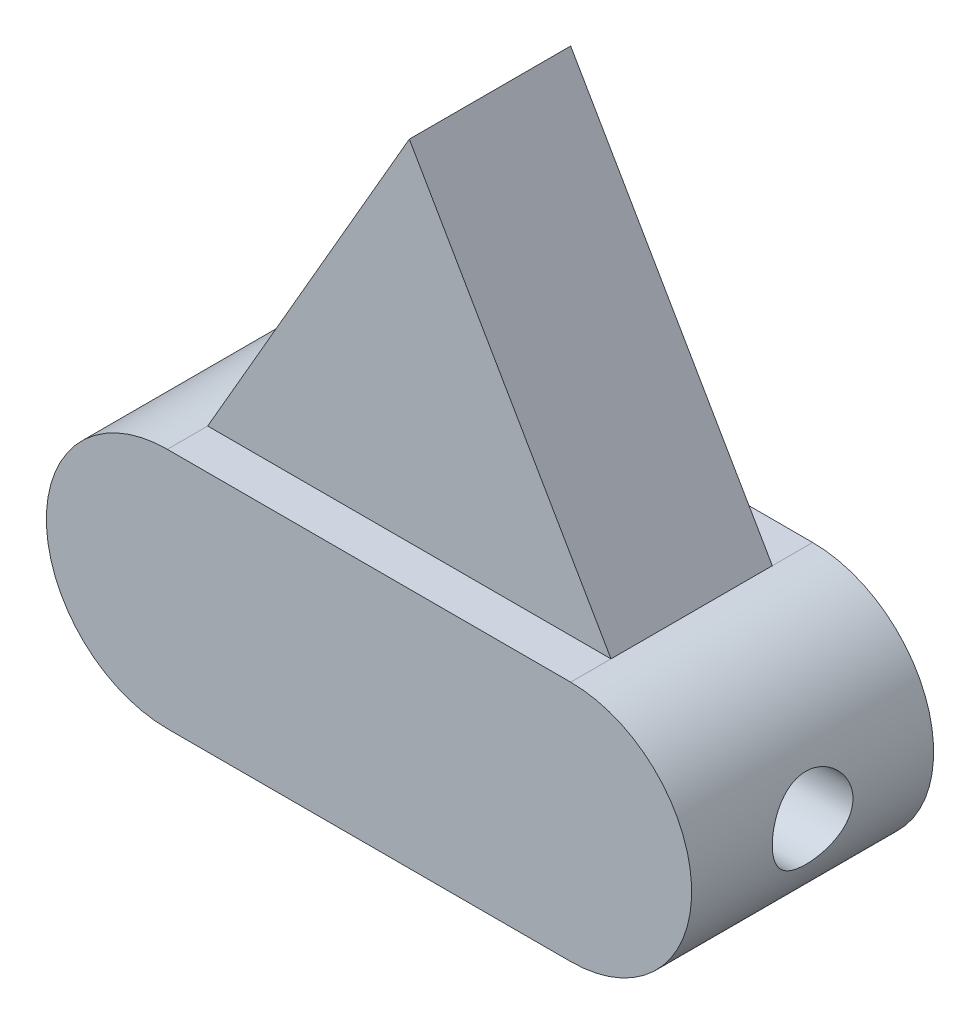
ISO-10303-21;
HEADER;
FILE_DESCRIPTION(('STEP AP214'),'2;1');
FILE_NAME('part.step','',(''),(''),'','','');
FILE_SCHEMA(('AUTOMOTIVE_DESIGN { 1 0 10303 214 1 1 1 1 }'));
ENDSEC;
DATA;
#1=APPLICATION_CONTEXT('core data for automotive mechanical design processes');
#2=APPLICATION_PROTOCOL_DEFINITION('international standard','automotive_design',2000,#1);
#3=PRODUCT_CONTEXT('',#1,'mechanical');
#4=PRODUCT('Part','Part','',(#3));
#5=PRODUCT_RELATED_PRODUCT_CATEGORY('part','',(#4));
#6=PRODUCT_DEFINITION_FORMATION('','',#4);
#7=PRODUCT_DEFINITION_CONTEXT('part definition',#1,'design');
#8=PRODUCT_DEFINITION('design','',#6,#7);
#9=PRODUCT_DEFINITION_SHAPE('','',#8);
#10=(LENGTH_UNIT() NAMED_UNIT(*) SI_UNIT(.MILLI.,.METRE.));
#11=(NAMED_UNIT(*) PLANE_ANGLE_UNIT() SI_UNIT($,.RADIAN.));
#12=(NAMED_UNIT(*) SI_UNIT($,.STERADIAN.) SOLID_ANGLE_UNIT());
#13=UNCERTAINTY_MEASURE_WITH_UNIT(LENGTH_MEASURE(1.E-05),#10,'distance_accuracy_value','');
#14=(GEOMETRIC_REPRESENTATION_CONTEXT(3) GLOBAL_UNCERTAINTY_ASSIGNED_CONTEXT((#13)) GLOBAL_UNIT_ASSIGNED_CONTEXT((#10,
#11,#12)) REPRESENTATION_CONTEXT('',''));
#15=CARTESIAN_POINT('',(0.,0.,0.));
#16=DIRECTION('',(0.,0.,1.));
#17=DIRECTION('',(1.,0.,0.));
#18=AXIS2_PLACEMENT_3D('',#15,#16,#17);
#19=CARTESIAN_POINT('',(0.,76.2,0.));
#20=DIRECTION('',(0.,1.,0.));
#21=DIRECTION('',(0.,0.,1.));
#22=AXIS2_PLACEMENT_3D('',#19,#20,#21);
#23=PLANE('',#22);
#24=DIRECTION('',(0.,0.,1.));
#25=VECTOR('',#24,1.);
#26=CARTESIAN_POINT('',(-63.5,76.2,-38.1));
#27=LINE('',#26,#25);
#28=CARTESIAN_POINT('',(-63.5,76.2,-38.1));
#29=VERTEX_POINT('',#28);
#30=CARTESIAN_POINT('',(-63.5,76.2,-25.4));
#31=VERTEX_POINT('',#30);
#32=EDGE_CURVE('E175',#29,#31,#27,.T.);
#33=ORIENTED_EDGE('',*,*,#32,.T.);
#34=DIRECTION('',(1.,0.,0.));
#35=VECTOR('',#34,1.);
#36=CARTESIAN_POINT('',(-63.5,76.2,-25.4));
#37=LINE('',#36,#35);
#38=CARTESIAN_POINT('',(63.5,76.2,-25.4));
#39=VERTEX_POINT('',#38);
#40=EDGE_CURVE('E131',#31,#39,#37,.T.);
#41=ORIENTED_EDGE('',*,*,#40,.T.);
#42=DIRECTION('',(0.,0.,-1.));
#43=VECTOR('',#42,1.);
#44=CARTESIAN_POINT('',(63.5,76.2,-38.1));
#45=LINE('',#44,#43);
#46=CARTESIAN_POINT('',(63.5,76.2,-38.1));
#47=VERTEX_POINT('',#46);
#48=EDGE_CURVE('E171',#39,#47,#45,.T.);
#49=ORIENTED_EDGE('',*,*,#48,.T.);
#50=DIRECTION('',(-1.,0.,0.));
#51=VECTOR('',#50,1.);
#52=CARTESIAN_POINT('',(-63.5,76.2,-38.1));
#53=LINE('',#52,#51);
#54=EDGE_CURVE('E170',#47,#29,#53,.T.);
#55=ORIENTED_EDGE('',*,*,#54,.T.);
#56=EDGE_LOOP('',(#33,#41,#49,#55));
#57=FACE_BOUND('',#56,.T.);
#58=ADVANCED_FACE('F38',(#57),#23,.T.);
#59=CARTESIAN_POINT('',(-63.5,76.2,-38.1));
#60=DIRECTION('',(0.,0.,1.));
#61=DIRECTION('',(1.,0.,0.));
#62=AXIS2_PLACEMENT_3D('',#59,#60,#61);
#63=PLANE('',#62);
#64=DIRECTION('',(-1.,0.,0.));
#65=VECTOR('',#64,1.);
#66=CARTESIAN_POINT('',(-63.5,0.,-38.1));
#67=LINE('',#66,#65);
#68=CARTESIAN_POINT('',(63.5,0.,-38.1));
#69=VERTEX_POINT('',#68);
#70=CARTESIAN_POINT('',(-63.5,0.,-38.1));
#71=VERTEX_POINT('',#70);
#72=EDGE_CURVE('E183',#69,#71,#67,.T.);
#73=ORIENTED_EDGE('',*,*,#72,.T.);
#74=CARTESIAN_POINT('',(-63.5,38.1,-38.1));
#75=DIRECTION('',(0.,0.,1.));
#76=DIRECTION('',(1.,0.,0.));
#77=AXIS2_PLACEMENT_3D('',#74,#75,#76);
#78=CIRCLE('',#77,38.1);
#79=EDGE_CURVE('E159',#71,#29,#78,.F.);
#80=ORIENTED_EDGE('',*,*,#79,.T.);
#81=ORIENTED_EDGE('',*,*,#54,.F.);
#82=CARTESIAN_POINT('',(63.5,38.1,-38.1));
#83=DIRECTION('',(0.,0.,1.));
#84=DIRECTION('',(1.,0.,0.));
#85=AXIS2_PLACEMENT_3D('',#82,#83,#84);
#86=CIRCLE('',#85,38.1);
#87=EDGE_CURVE('E151',#47,#69,#86,.F.);
#88=ORIENTED_EDGE('',*,*,#87,.T.);
#89=EDGE_LOOP('',(#73,#80,#81,#88));
#90=FACE_BOUND('',#89,.T.);
#91=ADVANCED_FACE('F40',(#90),#63,.F.);
#92=CARTESIAN_POINT('',(-63.5,76.2,38.1));
#93=DIRECTION('',(0.,0.,-1.));
#94=DIRECTION('',(-1.,0.,0.));
#95=AXIS2_PLACEMENT_3D('',#92,#93,#94);
#96=PLANE('',#95);
#97=DIRECTION('',(1.,0.,0.));
#98=VECTOR('',#97,1.);
#99=CARTESIAN_POINT('',(-63.5,0.,38.1));
#100=LINE('',#99,#98);
#101=CARTESIAN_POINT('',(-63.5,0.,38.1));
#102=VERTEX_POINT('',#101);
#103=CARTESIAN_POINT('',(63.5,0.,38.1));
#104=VERTEX_POINT('',#103);
#105=EDGE_CURVE('E189',#102,#104,#100,.T.);
#106=ORIENTED_EDGE('',*,*,#105,.T.);
#107=CARTESIAN_POINT('',(63.5,38.1,38.1));
#108=DIRECTION('',(0.,0.,1.));
#109=DIRECTION('',(-1.,0.,0.));
#110=AXIS2_PLACEMENT_3D('',#107,#108,#109);
#111=CIRCLE('',#110,38.1);
#112=CARTESIAN_POINT('',(63.5,76.2,38.1));
#113=VERTEX_POINT('',#112);
#114=EDGE_CURVE('E150',#104,#113,#111,.T.);
#115=ORIENTED_EDGE('',*,*,#114,.T.);
#116=DIRECTION('',(1.,0.,0.));
#117=VECTOR('',#116,1.);
#118=CARTESIAN_POINT('',(-63.5,76.2,38.1));
#119=LINE('',#118,#117);
#120=CARTESIAN_POINT('',(-63.5,76.2,38.1));
#121=VERTEX_POINT('',#120);
#122=EDGE_CURVE('E52',#121,#113,#119,.T.);
#123=ORIENTED_EDGE('',*,*,#122,.F.);
#124=CARTESIAN_POINT('',(-63.5,38.1,38.1));
#125=DIRECTION('',(0.,0.,1.));
#126=DIRECTION('',(-1.,0.,0.));
#127=AXIS2_PLACEMENT_3D('',#124,#125,#126);
#128=CIRCLE('',#127,38.1);
#129=EDGE_CURVE('E155',#121,#102,#128,.T.);
#130=ORIENTED_EDGE('',*,*,#129,.T.);
#131=EDGE_LOOP('',(#106,#115,#123,#130));
#132=FACE_BOUND('',#131,.T.);
#133=ADVANCED_FACE('F227',(#132),#96,.F.);
#134=DIRECTION('',(1.,0.,0.));
#135=VECTOR('',#134,1.);
#136=CARTESIAN_POINT('',(-63.5,76.2,25.4));
#137=LINE('',#136,#135);
#138=CARTESIAN_POINT('',(-63.5,76.2,25.3999999999999));
#139=VERTEX_POINT('',#138);
#140=CARTESIAN_POINT('',(63.5,76.2,25.4));
#141=VERTEX_POINT('',#140);
#142=EDGE_CURVE('E59',#139,#141,#137,.T.);
#143=ORIENTED_EDGE('',*,*,#142,.F.);
#144=EDGE_CURVE('E174',#139,#121,#27,.T.);
#145=ORIENTED_EDGE('',*,*,#144,.T.);
#146=ORIENTED_EDGE('',*,*,#122,.T.);
#147=EDGE_CURVE('E167',#113,#141,#45,.T.);
#148=ORIENTED_EDGE('',*,*,#147,.T.);
#149=EDGE_LOOP('',(#143,#145,#146,#148));
#150=FACE_BOUND('',#149,.T.);
#151=ADVANCED_FACE('F223',(#150),#23,.T.);
#152=CARTESIAN_POINT('',(0.,0.,0.));
#153=DIRECTION('',(0.,1.,0.));
#154=DIRECTION('',(0.,0.,1.));
#155=AXIS2_PLACEMENT_3D('',#152,#153,#154);
#156=PLANE('',#155);
#157=DIRECTION('',(0.,0.,-1.));
#158=VECTOR('',#157,1.);
#159=CARTESIAN_POINT('',(63.5,0.,-38.1));
#160=LINE('',#159,#158);
#161=EDGE_CURVE('E163',#104,#69,#160,.T.);
#162=ORIENTED_EDGE('',*,*,#161,.F.);
#163=ORIENTED_EDGE('',*,*,#105,.F.);
#164=DIRECTION('',(0.,0.,1.));
#165=VECTOR('',#164,1.);
#166=CARTESIAN_POINT('',(-63.5,0.,-38.1));
#167=LINE('',#166,#165);
#168=EDGE_CURVE('E186',#71,#102,#167,.T.);
#169=ORIENTED_EDGE('',*,*,#168,.F.);
#170=ORIENTED_EDGE('',*,*,#72,.F.);
#171=EDGE_LOOP('',(#162,#163,#169,#170));
#172=FACE_BOUND('',#171,.T.);
#173=ADVANCED_FACE('F205',(#172),#156,.F.);
#174=CARTESIAN_POINT('',(-63.5,38.1,-123.294189942742));
#175=DIRECTION('',(0.,0.,1.));
#176=DIRECTION('',(1.,0.,0.));
#177=AXIS2_PLACEMENT_3D('',#174,#175,#176);
#178=CYLINDRICAL_SURFACE('',#177,38.1);
#179=CARTESIAN_POINT('',(-101.6,38.1,-12.7));
#180=CARTESIAN_POINT('',(-101.60000009243,37.753521874116,-12.7000001402326));
#181=CARTESIAN_POINT('',(-101.595262917619,37.4070458129739,-12.6858098482789));
#182=CARTESIAN_POINT('',(-101.576444715908,36.7166699597641,-12.6291865729658));
#183=CARTESIAN_POINT('',(-101.562363764943,36.3727701467825,-12.5867538191295));
#184=CARTESIAN_POINT('',(-101.525241069632,35.6900338719856,-12.4740444406639));
#185=CARTESIAN_POINT('',(-101.502198629078,35.3511978056918,-12.4037656526967));
#186=CARTESIAN_POINT('',(-101.447774627601,34.6810179641136,-12.2360078383451));
#187=CARTESIAN_POINT('',(-101.416393010046,34.3496742397268,-12.1385286272398));
#188=CARTESIAN_POINT('',(-101.346184316314,33.6972970508569,-11.9174087519923));
#189=CARTESIAN_POINT('',(-101.307370095179,33.3762468863889,-11.7938132196327));
#190=CARTESIAN_POINT('',(-101.223270393508,32.745938500865,-11.5213675137675));
#191=CARTESIAN_POINT('',(-101.177984931389,32.4366802462541,-11.372517412133));
#192=CARTESIAN_POINT('',(-101.08209955622,31.8318620489171,-11.0506919264413));
#193=CARTESIAN_POINT('',(-101.031499755813,31.5363018160347,-10.8777170537151));
#194=CARTESIAN_POINT('',(-100.926239198251,30.960509835292,-10.5087887174703));
#195=CARTESIAN_POINT('',(-100.871576986238,30.6802836419459,-10.3128270070837));
#196=CARTESIAN_POINT('',(-100.757829376552,30.1284272477163,-9.89282397837379));
#197=CARTESIAN_POINT('',(-100.698659340705,29.8573340745837,-9.66809974268742));
#198=CARTESIAN_POINT('',(-100.579030888554,29.334881407299,-9.19708686613292));
#199=CARTESIAN_POINT('',(-100.518572443651,29.0835223517654,-8.95079774621218));
#200=CARTESIAN_POINT('',(-100.397954573672,28.6019689127692,-8.4380770391666));
#201=CARTESIAN_POINT('',(-100.337795272312,28.371782692226,-8.17163775493952));
#202=CARTESIAN_POINT('',(-100.219450052484,27.9342066455236,-7.62039630605332));
#203=CARTESIAN_POINT('',(-100.161263464424,27.7268090296205,-7.33560046929303));
#204=CARTESIAN_POINT('',(-100.046820704427,27.3304274790285,-6.74075047068148));
#205=CARTESIAN_POINT('',(-99.9906694778412,27.1421521252449,-6.43020328398387));
#206=CARTESIAN_POINT('',(-99.8838526067544,26.792537839985,-5.79337921279167));
#207=CARTESIAN_POINT('',(-99.8331870944136,26.6311995574192,-5.46710194960566));
#208=CARTESIAN_POINT('',(-99.7389571320159,26.3368422304413,-4.80110712696741));
#209=CARTESIAN_POINT('',(-99.6953909911299,26.2038164406387,-4.46139279179197));
#210=CARTESIAN_POINT('',(-99.6167827146275,25.9672523731126,-3.77088915479267));
#211=CARTESIAN_POINT('',(-99.5817401953927,25.8637127682828,-3.42010035219507));
#212=CARTESIAN_POINT('',(-99.52239381447,25.6901137305408,-2.72207217782428));
#213=CARTESIAN_POINT('',(-99.4977679133893,25.6190437816672,-2.37511144343052));
#214=CARTESIAN_POINT('',(-99.4584048979867,25.5060844470512,-1.6759138162167));
#215=CARTESIAN_POINT('',(-99.4436675782741,25.464194455226,-1.32367703313814));
#216=CARTESIAN_POINT('',(-99.4245816293682,25.4100329834838,-0.616746678771371));
#217=CARTESIAN_POINT('',(-99.4202302246346,25.3977535903972,-0.262053789272375));
#218=CARTESIAN_POINT('',(-99.4220570146951,25.4029203508646,0.447082874566697));
#219=CARTESIAN_POINT('',(-99.4282349123739,25.4203656656484,0.801526655653758));
#220=CARTESIAN_POINT('',(-99.4503876853228,25.4833180382983,1.49121043424532));
#221=CARTESIAN_POINT('',(-99.4659012135418,25.527504171694,1.8265868705467));
#222=CARTESIAN_POINT('',(-99.5058439213438,25.6423559516704,2.49222057553852));
#223=CARTESIAN_POINT('',(-99.5302727885392,25.7130206704613,2.82247802317231));
#224=CARTESIAN_POINT('',(-99.5873170784727,25.88020725819,3.47567791572014));
#225=CARTESIAN_POINT('',(-99.6199331779448,25.9767312646291,3.79861975353924));
#226=CARTESIAN_POINT('',(-99.6924034460525,26.1948278375501,4.43509314043332));
#227=CARTESIAN_POINT('',(-99.7322578068864,26.3164010691779,4.74862443937174));
#228=CARTESIAN_POINT('',(-99.8187687479027,26.5857760617701,5.36925468858557));
#229=CARTESIAN_POINT('',(-99.8655233140279,26.7339637425986,5.67617237841689));
#230=CARTESIAN_POINT('',(-99.9640637048825,27.0541810317114,6.27659907274601));
#231=CARTESIAN_POINT('',(-100.015851381242,27.2262194244319,6.57010308366003));
#232=CARTESIAN_POINT('',(-100.123043937267,27.5929014626403,7.14186279879385));
#233=CARTESIAN_POINT('',(-100.178448242796,27.7875415239384,7.42012091044702));
#234=CARTESIAN_POINT('',(-100.291467116698,28.1983164692495,7.96001117479735));
#235=CARTESIAN_POINT('',(-100.349082695083,28.4144612492039,8.22163558146098));
#236=CARTESIAN_POINT('',(-100.46807490809,28.8787307041641,8.73987739923944));
#237=CARTESIAN_POINT('',(-100.529490730089,29.1279363798233,8.9955184618617));
#238=CARTESIAN_POINT('',(-100.651413041207,29.6469806735258,9.48491671485309));
#239=CARTESIAN_POINT('',(-100.711919898848,29.9168106440656,9.71868298658569));
#240=CARTESIAN_POINT('',(-100.830436162278,30.4756862997476,10.1630384469158));
#241=CARTESIAN_POINT('',(-100.888444227448,30.7647420932277,10.3736152862365));
#242=CARTESIAN_POINT('',(-101.000325291055,31.3600243373695,10.7698896263757));
#243=CARTESIAN_POINT('',(-101.054199947815,31.6662438157275,10.9555971272956));
#244=CARTESIAN_POINT('',(-101.156881713449,32.2972041618237,11.302588057753));
#245=CARTESIAN_POINT('',(-101.20563163684,32.6221018723139,11.4636035377388));
#246=CARTESIAN_POINT('',(-101.29604299066,33.2853217523058,11.7575693774447));
#247=CARTESIAN_POINT('',(-101.337704330337,33.6236440936085,11.8905193778603));
#248=CARTESIAN_POINT('',(-101.412720650241,34.3111810477579,12.1271175704734));
#249=CARTESIAN_POINT('',(-101.446077969938,34.6603925615607,12.2307740165757));
#250=CARTESIAN_POINT('',(-101.503515527802,35.367148647068,12.407828875438));
#251=CARTESIAN_POINT('',(-101.527596192945,35.7246928344435,12.4812286808223));
#252=CARTESIAN_POINT('',(-101.564932730602,36.4296570185031,12.5945158620769));
#253=CARTESIAN_POINT('',(-101.578612738693,36.7768436741303,12.635718482782));
#254=CARTESIAN_POINT('',(-101.596445609912,37.4736729103022,12.6893583070924));
#255=CARTESIAN_POINT('',(-101.600598748756,37.8233154194787,12.701796343168));
#256=CARTESIAN_POINT('',(-101.599262000887,38.5223614015099,12.6977859027152));
#257=CARTESIAN_POINT('',(-101.593773566881,38.8717649024414,12.6813417778978));
#258=CARTESIAN_POINT('',(-101.57330978884,39.5677468931804,12.6197369919361));
#259=CARTESIAN_POINT('',(-101.558334540607,39.9143254114808,12.5745766207873));
#260=CARTESIAN_POINT('',(-101.519880922497,40.5920919432715,12.4576999731207));
#261=CARTESIAN_POINT('',(-101.496661994058,40.9234346795585,12.386792596955));
#262=CARTESIAN_POINT('',(-101.442274817957,41.5787773020204,12.2189409653531));
#263=CARTESIAN_POINT('',(-101.411106766149,41.9027773688921,12.1219973514027));
#264=CARTESIAN_POINT('',(-101.341616982516,42.5413020043778,11.9028888146548));
#265=CARTESIAN_POINT('',(-101.303295889581,42.8558274163293,11.780726144248));
#266=CARTESIAN_POINT('',(-101.220440530932,43.4735969064891,11.5120788158628));
#267=CARTESIAN_POINT('',(-101.175903916241,43.7768366644723,11.3655849586169));
#268=CARTESIAN_POINT('',(-101.080493014154,44.3778604315557,11.0452448828625));
#269=CARTESIAN_POINT('',(-101.029483724799,44.6752958600864,10.8707849168496));
#270=CARTESIAN_POINT('',(-100.9233841954,45.2545107861884,10.4986420632386));
#271=CARTESIAN_POINT('',(-100.868293710238,45.5362893416188,10.3009577803584));
#272=CARTESIAN_POINT('',(-100.755411999691,46.0826128937751,9.88362677975481));
#273=CARTESIAN_POINT('',(-100.697620130268,46.3471537445021,9.66397481034739));
#274=CARTESIAN_POINT('',(-100.58080489698,46.8574213890616,9.2041047031429));
#275=CARTESIAN_POINT('',(-100.521781501868,47.1031477047991,8.96388604305535));
#276=CARTESIAN_POINT('',(-100.401319755798,47.5850978397854,8.45291676965225));
#277=CARTESIAN_POINT('',(-100.339893765375,47.8203800649567,8.18127412490446));
#278=CARTESIAN_POINT('',(-100.21906949134,48.2672775298533,7.61875990643696));
#279=CARTESIAN_POINT('',(-100.159671164773,48.478893271165,7.32788874045368));
#280=CARTESIAN_POINT('',(-100.044604902716,48.8770507037033,6.72864122031242));
#281=CARTESIAN_POINT('',(-99.988937954318,49.0635857731539,6.42026027368438));
#282=CARTESIAN_POINT('',(-99.8830426595972,49.4100408154447,5.78816135317518));
#283=CARTESIAN_POINT('',(-99.8328120502228,49.5699718780643,5.46444984243872));
#284=CARTESIAN_POINT('',(-99.7394101944445,49.861742619098,4.80431064548323));
#285=CARTESIAN_POINT('',(-99.6962265663069,49.9936316943247,4.46790656975904));
#286=CARTESIAN_POINT('',(-99.6182064342538,50.2284993479444,3.78419741577269));
#287=CARTESIAN_POINT('',(-99.5833699584973,50.331477828808,3.43689230074046));
#288=CARTESIAN_POINT('',(-99.5232256047702,50.5074928531201,2.73409819971137));
#289=CARTESIAN_POINT('',(-99.4979141334982,50.5805406888097,2.37861235370348));
#290=CARTESIAN_POINT('',(-99.4576800610004,50.6959914504428,1.66212221699534));
#291=CARTESIAN_POINT('',(-99.4427569362237,50.7383959207516,1.30111820533627));
#292=CARTESIAN_POINT('',(-99.4243116377321,50.7907268128879,0.595164692614107));
#293=CARTESIAN_POINT('',(-99.4202427353042,50.8022109919303,0.250344059798555));
#294=CARTESIAN_POINT('',(-99.4220540805361,50.7970879793283,-0.439054868522286));
#295=CARTESIAN_POINT('',(-99.4279339707409,50.7804817969558,-0.783633172289323));
#296=CARTESIAN_POINT('',(-99.4494527399255,50.7193458634512,-1.46996846805907));
#297=CARTESIAN_POINT('',(-99.4650910108341,50.6748178522033,-1.81172563451015));
#298=CARTESIAN_POINT('',(-99.5056285692197,50.5582707134992,-2.48995739213472));
#299=CARTESIAN_POINT('',(-99.530527886306,50.4862514981487,-2.82643196641522));
#300=CARTESIAN_POINT('',(-99.5882565903922,50.3170192043971,-3.48539131939688));
#301=CARTESIAN_POINT('',(-99.6209257849511,50.2203124837804,-3.80802050788027));
#302=CARTESIAN_POINT('',(-99.693480695196,50.0018983933857,-4.44385107212484));
#303=CARTESIAN_POINT('',(-99.7333662771584,49.8801914868698,-4.7570526224601));
#304=CARTESIAN_POINT('',(-99.8192374630469,49.6127192543762,-5.37212845022402));
#305=CARTESIAN_POINT('',(-99.8652230256799,49.4669540912565,-5.67400280431311));
#306=CARTESIAN_POINT('',(-99.9620724816602,49.1523462789077,-6.26479826343472));
#307=CARTESIAN_POINT('',(-100.012938255505,48.9834947230332,-6.55371431179009));
#308=CARTESIAN_POINT('',(-100.120488534862,48.6160835548628,-7.12905798882201));
#309=CARTESIAN_POINT('',(-100.177329529798,48.4165551624227,-7.41483800510634));
#310=CARTESIAN_POINT('',(-100.293335593654,47.9948615696665,-7.96887525644945));
#311=CARTESIAN_POINT('',(-100.352501711184,47.7726860820104,-8.2371244365921));
#312=CARTESIAN_POINT('',(-100.471572835257,47.3070919187733,-8.7544612059515));
#313=CARTESIAN_POINT('',(-100.53147803162,47.0636676840178,-9.0035437484597));
#314=CARTESIAN_POINT('',(-100.65041776877,46.5571915221377,-9.48087305430321));
#315=CARTESIAN_POINT('',(-100.709452671017,46.2941480352626,-9.70912868453171));
#316=CARTESIAN_POINT('',(-100.827435292204,45.7391223659532,-10.1520831765518));
#317=CARTESIAN_POINT('',(-100.886287517416,45.4464076203942,-10.3658908039254));
#318=CARTESIAN_POINT('',(-100.999757387517,44.8433148227464,-10.7679616961655));
#319=CARTESIAN_POINT('',(-101.054376641597,44.5329435614765,-10.9562346888029));
#320=CARTESIAN_POINT('',(-101.157866203395,43.8964687858399,-11.3058737838597));
#321=CARTESIAN_POINT('',(-101.206736467709,43.570365152718,-11.4672396831309));
#322=CARTESIAN_POINT('',(-101.29732612455,42.9046789867524,-11.7616963220699));
#323=CARTESIAN_POINT('',(-101.339045887367,42.5650971529984,-11.8947885259741));
#324=CARTESIAN_POINT('',(-101.412442969007,41.8903359495743,-12.1262041536058));
#325=CARTESIAN_POINT('',(-101.444485662507,41.5556376360696,-12.2258152220675));
#326=CARTESIAN_POINT('',(-101.500069442219,40.8785062463624,-12.3972522158859));
#327=CARTESIAN_POINT('',(-101.523610807469,40.5360734244205,-12.4690790532051));
#328=CARTESIAN_POINT('',(-101.56153896894,39.8460293424864,-12.5842643655433));
#329=CARTESIAN_POINT('',(-101.575927878892,39.4984192971507,-12.6276294137989));
#330=CARTESIAN_POINT('',(-101.595158334553,38.8005387929355,-12.6854971203946));
#331=CARTESIAN_POINT('',(-101.599999906559,38.4502683413865,-12.6999998582334));
#332=CARTESIAN_POINT('',(-101.6,38.1,-12.7));
#333=B_SPLINE_CURVE_WITH_KNOTS('',3,(#179,#180,#181,#182,#183,#184,#185,#186,#187,#188,#189,
#190,#191,#192,#193,#194,#195,#196,#197,#198,#199,#200,#201,#202,#203,#204,#205,#206,#207,#208,
#209,#210,#211,#212,#213,#214,#215,#216,#217,#218,#219,#220,#221,#222,#223,#224,#225,#226,#227,
#228,#229,#230,#231,#232,#233,#234,#235,#236,#237,#238,#239,#240,#241,#242,#243,#244,#245,#246,
#247,#248,#249,#250,#251,#252,#253,#254,#255,#256,#257,#258,#259,#260,#261,#262,#263,#264,#265,
#266,#267,#268,#269,#270,#271,#272,#273,#274,#275,#276,#277,#278,#279,#280,#281,#282,#283,#284,
#285,#286,#287,#288,#289,#290,#291,#292,#293,#294,#295,#296,#297,#298,#299,#300,#301,#302,#303,
#304,#305,#306,#307,#308,#309,#310,#311,#312,#313,#314,#315,#316,#317,#318,#319,#320,#321,#322,
#323,#324,#325,#326,#327,#328,#329,#330,#331,#332),.UNSPECIFIED.,.T.,.F.,(4,2,2,2,2,2,2,2,2,2,2,
2,2,2,2,2,2,2,2,2,2,2,2,2,2,2,2,2,2,2,2,2,2,2,2,2,2,2,2,2,2,2,2,2,2,2,2,2,2,2,2,2,2,2,2,2,2,2,2,
2,2,2,2,2,2,2,2,2,2,2,2,2,2,2,2,2,4),(0.,1.03910946864949,2.07821049267725,3.11739225952888,
4.15658108374578,5.19398855484086,6.23139307366596,7.26877560776691,8.30653146307539,
9.3765078578293,10.4465080275812,11.5169190083101,12.5869629486291,13.6880438837507,
14.7891513399338,15.8899961652436,16.9907914361943,18.0544972557995,19.1181809810272,
20.1815804147025,21.2449498419285,22.2596491221161,23.2743128513262,24.289060477461,
25.3038350522242,26.3347273538986,27.3660003563946,28.3971100416004,29.4286964322062,
30.5141985813651,31.5992480640105,32.6848726116641,33.7700593043266,34.8662957826494,
35.9625462945368,37.0584876124828,38.1543784818317,39.20274570583,40.2510825888542,
41.2992615312092,42.3474298885398,43.3651726512497,44.3828903409179,45.4005171744167,
46.4185296373215,47.4630938341645,48.5077208189775,49.5525981362193,50.5975019959639,
51.6899658867192,52.7824066194517,53.8751352133911,54.9674071598897,56.0577387962634,
57.1480741108082,58.2379976837686,59.3278663228989,60.3616995727856,61.3954956783742,
62.4292273717487,63.4629623701819,64.4769944034212,65.4910076479929,66.5050140286665,
67.5194127189532,68.5776676384678,69.6364054259503,70.6954210392347,71.7539836604753,
72.8543463082171,73.954288573035,75.0542391420277,76.1541327329475,77.2048894284979,
78.2556116321094,79.3060910864636,80.3565676473555),.UNSPECIFIED.);
#334=CARTESIAN_POINT('',(-101.6,38.1,-12.7));
#335=VERTEX_POINT('',#334);
#336=EDGE_CURVE('E134',#335,#335,#333,.T.);
#337=ORIENTED_EDGE('',*,*,#336,.F.);
#338=EDGE_LOOP('',(#337));
#339=FACE_BOUND('',#338,.T.);
#340=ORIENTED_EDGE('',*,*,#79,.F.);
#341=ORIENTED_EDGE('',*,*,#168,.T.);
#342=ORIENTED_EDGE('',*,*,#129,.F.);
#343=ORIENTED_EDGE('',*,*,#144,.F.);
#344=DIRECTION('',(0.,0.,-1.));
#345=VECTOR('',#344,1.);
#346=CARTESIAN_POINT('',(-63.5,76.2,25.4));
#347=LINE('',#346,#345);
#348=EDGE_CURVE('E66',#139,#31,#347,.T.);
#349=ORIENTED_EDGE('',*,*,#348,.T.);
#350=ORIENTED_EDGE('',*,*,#32,.F.);
#351=EDGE_LOOP('',(#340,#341,#342,#343,#349,#350));
#352=FACE_BOUND('',#351,.T.);
#353=ADVANCED_FACE('F208',(#339,#352),#178,.T.);
#354=CARTESIAN_POINT('',(63.5,38.1,-123.294189942742));
#355=DIRECTION('',(0.,0.,1.));
#356=DIRECTION('',(1.,0.,0.));
#357=AXIS2_PLACEMENT_3D('',#354,#355,#356);
#358=CYLINDRICAL_SURFACE('',#357,38.1);
#359=CARTESIAN_POINT('',(101.6,38.1,-12.7));
#360=CARTESIAN_POINT('',(101.60000009243,38.446478125884,-12.7000001402326));
#361=CARTESIAN_POINT('',(101.595262917619,38.7929541870261,-12.6858098482789));
#362=CARTESIAN_POINT('',(101.576444715908,39.483330040236,-12.6291865729658));
#363=CARTESIAN_POINT('',(101.562363764943,39.8272298532175,-12.5867538191295));
#364=CARTESIAN_POINT('',(101.525241069632,40.5099661280145,-12.4740444406639));
#365=CARTESIAN_POINT('',(101.502198629077,40.8488021943082,-12.4037656526967));
#366=CARTESIAN_POINT('',(101.447774627601,41.5189820358865,-12.2360078383451));
#367=CARTESIAN_POINT('',(101.416393010046,41.8503257602732,-12.1385286272398));
#368=CARTESIAN_POINT('',(101.346184316314,42.5027029491431,-11.9174087519923));
#369=CARTESIAN_POINT('',(101.307370095179,42.8237531136111,-11.7938132196327));
#370=CARTESIAN_POINT('',(101.223270393508,43.454061499135,-11.5213675137675));
#371=CARTESIAN_POINT('',(101.177984931389,43.763319753746,-11.372517412133));
#372=CARTESIAN_POINT('',(101.08209955622,44.3681379510829,-11.0506919264413));
#373=CARTESIAN_POINT('',(101.031499755813,44.6636981839654,-10.8777170537151));
#374=CARTESIAN_POINT('',(100.926239198251,45.2394901647081,-10.5087887174703));
#375=CARTESIAN_POINT('',(100.871576986238,45.5197163580541,-10.3128270070837));
#376=CARTESIAN_POINT('',(100.757829376552,46.0715727522837,-9.89282397837379));
#377=CARTESIAN_POINT('',(100.698659340705,46.3426659254163,-9.66809974268741));
#378=CARTESIAN_POINT('',(100.579030888554,46.865118592701,-9.19708686613291));
#379=CARTESIAN_POINT('',(100.518572443651,47.1164776482346,-8.95079774621217));
#380=CARTESIAN_POINT('',(100.397954573672,47.5980310872308,-8.4380770391666));
#381=CARTESIAN_POINT('',(100.337795272312,47.828217307774,-8.17163775493952));
#382=CARTESIAN_POINT('',(100.219450052484,48.2657933544764,-7.62039630605331));
#383=CARTESIAN_POINT('',(100.161263464424,48.4731909703795,-7.33560046929303));
#384=CARTESIAN_POINT('',(100.046820704427,48.8695725209715,-6.74075047068148));
#385=CARTESIAN_POINT('',(99.9906694778412,49.0578478747551,-6.43020328398387));
#386=CARTESIAN_POINT('',(99.8838526067543,49.407462160015,-5.79337921279167));
#387=CARTESIAN_POINT('',(99.8331870944136,49.5688004425808,-5.46710194960565));
#388=CARTESIAN_POINT('',(99.7389571320158,49.8631577695587,-4.8011071269674));
#389=CARTESIAN_POINT('',(99.6953909911299,49.9961835593613,-4.46139279179197));
#390=CARTESIAN_POINT('',(99.6167827146275,50.2327476268874,-3.77088915479266));
#391=CARTESIAN_POINT('',(99.5817401953927,50.3362872317173,-3.42010035219507));
#392=CARTESIAN_POINT('',(99.5223938144699,50.5098862694592,-2.72207217782428));
#393=CARTESIAN_POINT('',(99.4977679133893,50.5809562183328,-2.37511144343052));
#394=CARTESIAN_POINT('',(99.4584048979867,50.6939155529488,-1.6759138162167));
#395=CARTESIAN_POINT('',(99.443667578274,50.7358055447741,-1.32367703313813));
#396=CARTESIAN_POINT('',(99.4245816293682,50.7899670165162,-0.616746678771364));
#397=CARTESIAN_POINT('',(99.4202302246346,50.8022464096028,-0.262053789272369));
#398=CARTESIAN_POINT('',(99.4220570146951,50.7970796491354,0.447082874566701));
#399=CARTESIAN_POINT('',(99.4282349123738,50.7796343343516,0.801526655653762));
#400=CARTESIAN_POINT('',(99.4503876853227,50.7166819617017,1.49121043424533));
#401=CARTESIAN_POINT('',(99.4659012135418,50.672495828306,1.8265868705467));
#402=CARTESIAN_POINT('',(99.5058439213437,50.5576440483296,2.49222057553852));
#403=CARTESIAN_POINT('',(99.5302727885391,50.4869793295387,2.82247802317232));
#404=CARTESIAN_POINT('',(99.5873170784727,50.31979274181,3.47567791572015));
#405=CARTESIAN_POINT('',(99.6199331779448,50.2232687353709,3.79861975353924));
#406=CARTESIAN_POINT('',(99.6924034460525,50.0051721624499,4.43509314043333));
#407=CARTESIAN_POINT('',(99.7322578068864,49.8835989308221,4.74862443937174));
#408=CARTESIAN_POINT('',(99.8187687479026,49.6142239382299,5.36925468858557));
#409=CARTESIAN_POINT('',(99.8655233140279,49.4660362574014,5.6761723784169));
#410=CARTESIAN_POINT('',(99.9640637048824,49.1458189682886,6.27659907274601));
#411=CARTESIAN_POINT('',(100.015851381242,48.9737805755681,6.57010308366003));
#412=CARTESIAN_POINT('',(100.123043937267,48.6070985373597,7.14186279879385));
#413=CARTESIAN_POINT('',(100.178448242796,48.4124584760616,7.42012091044702));
#414=CARTESIAN_POINT('',(100.291467116698,48.0016835307505,7.96001117479735));
#415=CARTESIAN_POINT('',(100.349082695083,47.7855387507961,8.22163558146099));
#416=CARTESIAN_POINT('',(100.46807490809,47.3212692958359,8.73987739923945));
#417=CARTESIAN_POINT('',(100.529490730089,47.0720636201767,8.99551846186171));
#418=CARTESIAN_POINT('',(100.651413041207,46.5530193264742,9.48491671485309));
#419=CARTESIAN_POINT('',(100.711919898848,46.2831893559344,9.71868298658569));
#420=CARTESIAN_POINT('',(100.830436162278,45.7243137002524,10.1630384469158));
#421=CARTESIAN_POINT('',(100.888444227448,45.4352579067723,10.3736152862365));
#422=CARTESIAN_POINT('',(101.000325291055,44.8399756626305,10.7698896263757));
#423=CARTESIAN_POINT('',(101.054199947815,44.5337561842725,10.9555971272956));
#424=CARTESIAN_POINT('',(101.156881713449,43.9027958381764,11.302588057753));
#425=CARTESIAN_POINT('',(101.20563163684,43.5778981276861,11.4636035377388));
#426=CARTESIAN_POINT('',(101.29604299066,42.9146782476942,11.7575693774447));
#427=CARTESIAN_POINT('',(101.337704330337,42.5763559063915,11.8905193778603));
#428=CARTESIAN_POINT('',(101.412720650241,41.8888189522421,12.1271175704734));
#429=CARTESIAN_POINT('',(101.446077969938,41.5396074384393,12.2307740165758));
#430=CARTESIAN_POINT('',(101.503515527802,40.832851352932,12.407828875438));
#431=CARTESIAN_POINT('',(101.527596192945,40.4753071655565,12.4812286808224));
#432=CARTESIAN_POINT('',(101.564932730602,39.7703429814969,12.5945158620769));
#433=CARTESIAN_POINT('',(101.578612738693,39.4231563258697,12.635718482782));
#434=CARTESIAN_POINT('',(101.596445609912,38.7263270896978,12.6893583070924));
#435=CARTESIAN_POINT('',(101.600598748756,38.3766845805213,12.701796343168));
#436=CARTESIAN_POINT('',(101.599262000887,37.6776385984901,12.6977859027152));
#437=CARTESIAN_POINT('',(101.593773566881,37.3282350975586,12.6813417778978));
#438=CARTESIAN_POINT('',(101.57330978884,36.6322531068196,12.6197369919361));
#439=CARTESIAN_POINT('',(101.558334540607,36.2856745885192,12.5745766207873));
#440=CARTESIAN_POINT('',(101.519880922497,35.6079080567285,12.4576999731207));
#441=CARTESIAN_POINT('',(101.496661994058,35.2765653204415,12.386792596955));
#442=CARTESIAN_POINT('',(101.442274817957,34.6212226979796,12.2189409653531));
#443=CARTESIAN_POINT('',(101.411106766149,34.2972226311079,12.1219973514027));
#444=CARTESIAN_POINT('',(101.341616982516,33.6586979956222,11.9028888146548));
#445=CARTESIAN_POINT('',(101.303295889581,33.3441725836707,11.780726144248));
#446=CARTESIAN_POINT('',(101.220440530931,32.7264030935109,11.5120788158628));
#447=CARTESIAN_POINT('',(101.175903916241,32.4231633355277,11.3655849586169));
#448=CARTESIAN_POINT('',(101.080493014154,31.8221395684443,11.0452448828625));
#449=CARTESIAN_POINT('',(101.029483724799,31.5247041399136,10.8707849168496));
#450=CARTESIAN_POINT('',(100.9233841954,30.9454892138116,10.4986420632386));
#451=CARTESIAN_POINT('',(100.868293710238,30.6637106583812,10.3009577803584));
#452=CARTESIAN_POINT('',(100.75541199969,30.1173871062249,9.8836267797548));
#453=CARTESIAN_POINT('',(100.697620130268,29.8528462554979,9.66397481034738));
#454=CARTESIAN_POINT('',(100.58080489698,29.3425786109384,9.20410470314289));
#455=CARTESIAN_POINT('',(100.521781501868,29.0968522952009,8.96388604305534));
#456=CARTESIAN_POINT('',(100.401319755798,28.6149021602146,8.45291676965224));
#457=CARTESIAN_POINT('',(100.339893765375,28.3796199350433,8.18127412490445));
#458=CARTESIAN_POINT('',(100.21906949134,27.9327224701467,7.61875990643695));
#459=CARTESIAN_POINT('',(100.159671164773,27.721106728835,7.32788874045367));
#460=CARTESIAN_POINT('',(100.044604902716,27.3229492962967,6.72864122031241));
#461=CARTESIAN_POINT('',(99.9889379543179,27.1364142268461,6.42026027368437));
#462=CARTESIAN_POINT('',(99.8830426595971,26.7899591845553,5.78816135317517));
#463=CARTESIAN_POINT('',(99.8328120502228,26.6300281219357,5.46444984243871));
#464=CARTESIAN_POINT('',(99.7394101944445,26.338257380902,4.80431064548322));
#465=CARTESIAN_POINT('',(99.6962265663069,26.2063683056753,4.46790656975903));
#466=CARTESIAN_POINT('',(99.6182064342537,25.9715006520556,3.78419741577268));
#467=CARTESIAN_POINT('',(99.5833699584972,25.868522171192,3.43689230074045));
#468=CARTESIAN_POINT('',(99.5232256047702,25.6925071468799,2.73409819971137));
#469=CARTESIAN_POINT('',(99.4979141334982,25.6194593111903,2.37861235370347));
#470=CARTESIAN_POINT('',(99.4576800610003,25.5040085495572,1.66212221699533));
#471=CARTESIAN_POINT('',(99.4427569362237,25.4616040792484,1.30111820533626));
#472=CARTESIAN_POINT('',(99.424311637732,25.4092731871121,0.595164692614097));
#473=CARTESIAN_POINT('',(99.4202427353042,25.3977890080697,0.250344059798543));
#474=CARTESIAN_POINT('',(99.422054080536,25.4029120206717,-0.439054868522301));
#475=CARTESIAN_POINT('',(99.4279339707408,25.4195182030442,-0.783633172289338));
#476=CARTESIAN_POINT('',(99.4494527399254,25.4806541365488,-1.46996846805908));
#477=CARTESIAN_POINT('',(99.465091010834,25.5251821477967,-1.81172563451016));
#478=CARTESIAN_POINT('',(99.5056285692196,25.6417292865008,-2.48995739213473));
#479=CARTESIAN_POINT('',(99.530527886306,25.7137485018513,-2.82643196641523));
#480=CARTESIAN_POINT('',(99.5882565903922,25.8829807956029,-3.48539131939689));
#481=CARTESIAN_POINT('',(99.620925784951,25.9796875162196,-3.80802050788028));
#482=CARTESIAN_POINT('',(99.693480695196,26.1981016066143,-4.44385107212484));
#483=CARTESIAN_POINT('',(99.7333662771583,26.3198085131302,-4.75705262246011));
#484=CARTESIAN_POINT('',(99.8192374630468,26.5872807456238,-5.37212845022404));
#485=CARTESIAN_POINT('',(99.8652230256799,26.7330459087435,-5.67400280431313));
#486=CARTESIAN_POINT('',(99.9620724816602,27.0476537210923,-6.26479826343473));
#487=CARTESIAN_POINT('',(100.012938255505,27.2165052769668,-6.5537143117901));
#488=CARTESIAN_POINT('',(100.120488534862,27.5839164451373,-7.12905798882202));
#489=CARTESIAN_POINT('',(100.177329529798,27.7834448375773,-7.41483800510635));
#490=CARTESIAN_POINT('',(100.293335593654,28.2051384303335,-7.96887525644946));
#491=CARTESIAN_POINT('',(100.352501711184,28.4273139179896,-8.2371244365921));
#492=CARTESIAN_POINT('',(100.471572835257,28.8929080812267,-8.7544612059515));
#493=CARTESIAN_POINT('',(100.53147803162,29.1363323159822,-9.0035437484597));
#494=CARTESIAN_POINT('',(100.65041776877,29.6428084778623,-9.48087305430321));
#495=CARTESIAN_POINT('',(100.709452671017,29.9058519647374,-9.70912868453171));
#496=CARTESIAN_POINT('',(100.827435292204,30.4608776340468,-10.1520831765518));
#497=CARTESIAN_POINT('',(100.886287517416,30.7535923796058,-10.3658908039254));
#498=CARTESIAN_POINT('',(100.999757387517,31.3566851772536,-10.7679616961655));
#499=CARTESIAN_POINT('',(101.054376641597,31.6670564385235,-10.9562346888029));
#500=CARTESIAN_POINT('',(101.157866203395,32.3035312141601,-11.3058737838597));
#501=CARTESIAN_POINT('',(101.206736467708,32.629634847282,-11.4672396831309));
#502=CARTESIAN_POINT('',(101.29732612455,33.2953210132476,-11.7616963220699));
#503=CARTESIAN_POINT('',(101.339045887367,33.6349028470016,-11.8947885259741));
#504=CARTESIAN_POINT('',(101.412442969007,34.3096640504257,-12.1262041536058));
#505=CARTESIAN_POINT('',(101.444485662507,34.6443623639304,-12.2258152220675));
#506=CARTESIAN_POINT('',(101.500069442219,35.3214937536376,-12.3972522158859));
#507=CARTESIAN_POINT('',(101.523610807469,35.6639265755795,-12.4690790532051));
#508=CARTESIAN_POINT('',(101.56153896894,36.3539706575136,-12.5842643655433));
#509=CARTESIAN_POINT('',(101.575927878892,36.7015807028493,-12.6276294137989));
#510=CARTESIAN_POINT('',(101.595158334553,37.3994612070645,-12.6854971203946));
#511=CARTESIAN_POINT('',(101.599999906559,37.7497316586135,-12.6999998582334));
#512=CARTESIAN_POINT('',(101.6,38.1,-12.7));
#513=B_SPLINE_CURVE_WITH_KNOTS('',3,(#359,#360,#361,#362,#363,#364,#365,#366,#367,#368,#369,
#370,#371,#372,#373,#374,#375,#376,#377,#378,#379,#380,#381,#382,#383,#384,#385,#386,#387,#388,
#389,#390,#391,#392,#393,#394,#395,#396,#397,#398,#399,#400,#401,#402,#403,#404,#405,#406,#407,
#408,#409,#410,#411,#412,#413,#414,#415,#416,#417,#418,#419,#420,#421,#422,#423,#424,#425,#426,
#427,#428,#429,#430,#431,#432,#433,#434,#435,#436,#437,#438,#439,#440,#441,#442,#443,#444,#445,
#446,#447,#448,#449,#450,#451,#452,#453,#454,#455,#456,#457,#458,#459,#460,#461,#462,#463,#464,
#465,#466,#467,#468,#469,#470,#471,#472,#473,#474,#475,#476,#477,#478,#479,#480,#481,#482,#483,
#484,#485,#486,#487,#488,#489,#490,#491,#492,#493,#494,#495,#496,#497,#498,#499,#500,#501,#502,
#503,#504,#505,#506,#507,#508,#509,#510,#511,#512),.UNSPECIFIED.,.T.,.F.,(4,2,2,2,2,2,2,2,2,2,2,
2,2,2,2,2,2,2,2,2,2,2,2,2,2,2,2,2,2,2,2,2,2,2,2,2,2,2,2,2,2,2,2,2,2,2,2,2,2,2,2,2,2,2,2,2,2,2,2,
2,2,2,2,2,2,2,2,2,2,2,2,2,2,2,2,2,4),(0.,1.03910946864949,2.07821049267726,3.11739225952888,
4.15658108374577,5.19398855484086,6.23139307366595,7.2687756077669,8.30653146307538,
9.3765078578293,10.4465080275812,11.5169190083101,12.5869629486291,13.6880438837507,
14.7891513399338,15.8899961652436,16.9907914361943,18.0544972557995,19.1181809810272,
20.1815804147024,21.2449498419285,22.2596491221161,23.2743128513262,24.289060477461,
25.3038350522242,26.3347273538986,27.3660003563946,28.3971100416003,29.4286964322062,
30.514198581365,31.5992480640105,32.6848726116641,33.7700593043266,34.8662957826494,
35.9625462945368,37.0584876124829,38.1543784818317,39.20274570583,40.2510825888542,
41.2992615312092,42.3474298885398,43.3651726512497,44.3828903409179,45.4005171744167,
46.4185296373215,47.4630938341645,48.5077208189775,49.5525981362194,50.5975019959639,
51.6899658867192,52.7824066194517,53.8751352133911,54.9674071598897,56.0577387962634,
57.1480741108082,58.2379976837686,59.3278663228989,60.3616995727856,61.3954956783742,
62.4292273717487,63.4629623701819,64.4769944034212,65.4910076479929,66.5050140286665,
67.5194127189532,68.5776676384678,69.6364054259503,70.6954210392347,71.7539836604753,
72.8543463082171,73.9542885730349,75.0542391420276,76.1541327329475,77.2048894284979,
78.2556116321094,79.3060910864636,80.3565676473556),.UNSPECIFIED.);
#514=CARTESIAN_POINT('',(101.6,38.1,-12.7));
#515=VERTEX_POINT('',#514);
#516=EDGE_CURVE('E11',#515,#515,#513,.T.);
#517=ORIENTED_EDGE('',*,*,#516,.F.);
#518=EDGE_LOOP('',(#517));
#519=FACE_BOUND('',#518,.T.);
#520=ORIENTED_EDGE('',*,*,#87,.F.);
#521=ORIENTED_EDGE('',*,*,#48,.F.);
#522=DIRECTION('',(0.,0.,-1.));
#523=VECTOR('',#522,1.);
#524=CARTESIAN_POINT('',(63.5,76.2,25.4));
#525=LINE('',#524,#523);
#526=EDGE_CURVE('E123',#141,#39,#525,.T.);
#527=ORIENTED_EDGE('',*,*,#526,.F.);
#528=ORIENTED_EDGE('',*,*,#147,.F.);
#529=ORIENTED_EDGE('',*,*,#114,.F.);
#530=ORIENTED_EDGE('',*,*,#161,.T.);
#531=EDGE_LOOP('',(#520,#521,#527,#528,#529,#530));
#532=FACE_BOUND('',#531,.T.);
#533=ADVANCED_FACE('F201',(#519,#532),#358,.T.);
#534=CARTESIAN_POINT('',(0.,186.185226280624,25.4));
#535=DIRECTION('',(0.866025403784439,-0.5,0.));
#536=DIRECTION('',(0.5,0.866025403784439,0.));
#537=AXIS2_PLACEMENT_3D('',#534,#535,#536);
#538=PLANE('',#537);
#539=DIRECTION('',(-0.5,-0.866025403784439,0.));
#540=VECTOR('',#539,1.);
#541=CARTESIAN_POINT('',(0.,186.185226280624,-25.4));
#542=LINE('',#541,#540);
#543=CARTESIAN_POINT('',(0.,186.185226280624,-25.4));
#544=VERTEX_POINT('',#543);
#545=EDGE_CURVE('E140',#544,#31,#542,.T.);
#546=ORIENTED_EDGE('',*,*,#545,.T.);
#547=ORIENTED_EDGE('',*,*,#348,.F.);
#548=DIRECTION('',(-0.5,-0.866025403784439,0.));
#549=VECTOR('',#548,1.);
#550=CARTESIAN_POINT('',(0.,186.185226280624,25.4));
#551=LINE('',#550,#549);
#552=CARTESIAN_POINT('',(0.,186.185226280624,25.4));
#553=VERTEX_POINT('',#552);
#554=EDGE_CURVE('E109',#553,#139,#551,.T.);
#555=ORIENTED_EDGE('',*,*,#554,.F.);
#556=DIRECTION('',(0.,0.,-1.));
#557=VECTOR('',#556,1.);
#558=CARTESIAN_POINT('',(0.,186.185226280624,25.4));
#559=LINE('',#558,#557);
#560=EDGE_CURVE('E113',#553,#544,#559,.T.);
#561=ORIENTED_EDGE('',*,*,#560,.T.);
#562=EDGE_LOOP('',(#546,#547,#555,#561));
#563=FACE_BOUND('',#562,.T.);
#564=ADVANCED_FACE('F125',(#563),#538,.F.);
#565=CARTESIAN_POINT('',(63.5,76.2,25.4));
#566=DIRECTION('',(-0.866025403784439,-0.5,0.));
#567=DIRECTION('',(0.5,-0.866025403784439,0.));
#568=AXIS2_PLACEMENT_3D('',#565,#566,#567);
#569=PLANE('',#568);
#570=DIRECTION('',(-0.5,0.866025403784439,0.));
#571=VECTOR('',#570,1.);
#572=CARTESIAN_POINT('',(63.5,76.2,-25.4));
#573=LINE('',#572,#571);
#574=EDGE_CURVE('E118',#39,#544,#573,.T.);
#575=ORIENTED_EDGE('',*,*,#574,.T.);
#576=ORIENTED_EDGE('',*,*,#560,.F.);
#577=DIRECTION('',(-0.5,0.866025403784439,0.));
#578=VECTOR('',#577,1.);
#579=CARTESIAN_POINT('',(63.5,76.2,25.4));
#580=LINE('',#579,#578);
#581=EDGE_CURVE('E105',#141,#553,#580,.T.);
#582=ORIENTED_EDGE('',*,*,#581,.F.);
#583=ORIENTED_EDGE('',*,*,#526,.T.);
#584=EDGE_LOOP('',(#575,#576,#582,#583));
#585=FACE_BOUND('',#584,.T.);
#586=ADVANCED_FACE('F116',(#585),#569,.F.);
#587=CARTESIAN_POINT('',(0.,0.,25.4));
#588=DIRECTION('',(0.,0.,1.));
#589=DIRECTION('',(1.,0.,0.));
#590=AXIS2_PLACEMENT_3D('',#587,#588,#589);
#591=PLANE('',#590);
#592=ORIENTED_EDGE('',*,*,#554,.T.);
#593=ORIENTED_EDGE('',*,*,#142,.T.);
#594=ORIENTED_EDGE('',*,*,#581,.T.);
#595=EDGE_LOOP('',(#592,#593,#594));
#596=FACE_BOUND('',#595,.T.);
#597=ADVANCED_FACE('F107',(#596),#591,.T.);
#598=CARTESIAN_POINT('',(0.,0.,-25.4));
#599=DIRECTION('',(0.,0.,1.));
#600=DIRECTION('',(1.,0.,0.));
#601=AXIS2_PLACEMENT_3D('',#598,#599,#600);
#602=PLANE('',#601);
#603=ORIENTED_EDGE('',*,*,#545,.F.);
#604=ORIENTED_EDGE('',*,*,#574,.F.);
#605=ORIENTED_EDGE('',*,*,#40,.F.);
#606=EDGE_LOOP('',(#603,#604,#605));
#607=FACE_BOUND('',#606,.T.);
#608=ADVANCED_FACE('F210',(#607),#602,.F.);
#609=CARTESIAN_POINT('',(-101.6,38.1,0.));
#610=DIRECTION('',(1.,0.,0.));
#611=DIRECTION('',(0.,0.,-1.));
#612=AXIS2_PLACEMENT_3D('',#609,#610,#611);
#613=CYLINDRICAL_SURFACE('',#612,12.7);
#614=ORIENTED_EDGE('',*,*,#336,.T.);
#615=EDGE_LOOP('',(#614));
#616=FACE_BOUND('',#615,.T.);
#617=ORIENTED_EDGE('',*,*,#516,.T.);
#618=EDGE_LOOP('',(#617));
#619=FACE_BOUND('',#618,.T.);
#620=ADVANCED_FACE('F212',(#616,#619),#613,.F.);
#621=CLOSED_SHELL('',(#58,#91,#133,#151,#173,#353,#533,#564,#586,#597,#608,#620));
#622=MANIFOLD_SOLID_BREP('B2',#621);
#623=ADVANCED_BREP_SHAPE_REPRESENTATION('',(#18,#622),#14);
#624=SHAPE_DEFINITION_REPRESENTATION(#9,#623);
ENDSEC;
END-ISO-10303-21;
